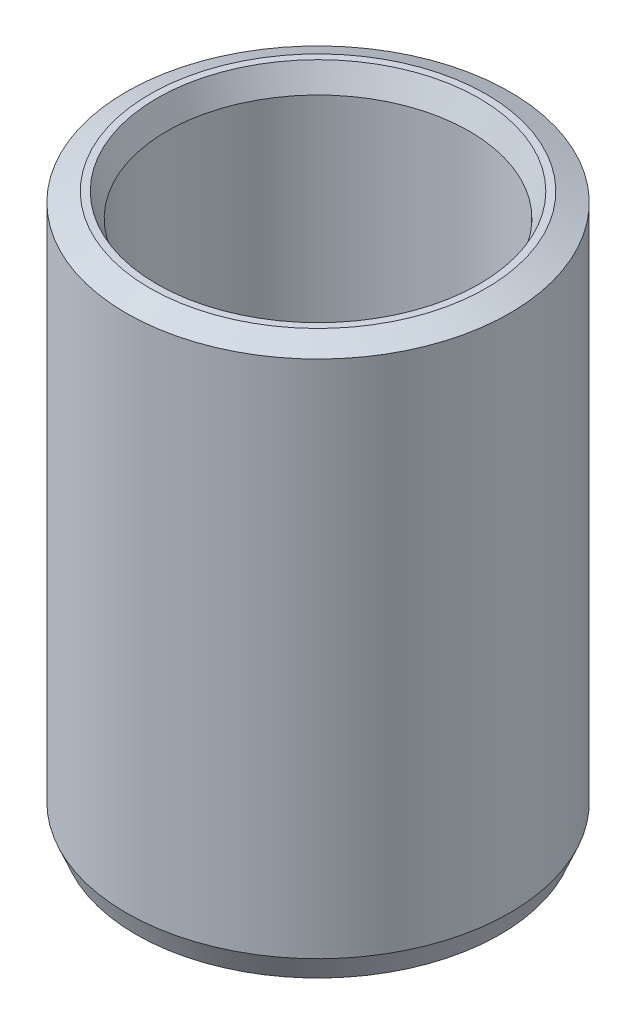
ISO-10303-21;
HEADER;
FILE_DESCRIPTION(('STEP AP214'),'2;1');
FILE_NAME('part.step','',(''),(''),'','','');
FILE_SCHEMA(('AUTOMOTIVE_DESIGN { 1 0 10303 214 1 1 1 1 }'));
ENDSEC;
DATA;
#1=APPLICATION_CONTEXT('core data for automotive mechanical design processes');
#2=APPLICATION_PROTOCOL_DEFINITION('international standard','automotive_design',2000,#1);
#3=PRODUCT_CONTEXT('',#1,'mechanical');
#4=PRODUCT('Part','Part','',(#3));
#5=PRODUCT_RELATED_PRODUCT_CATEGORY('part','',(#4));
#6=PRODUCT_DEFINITION_FORMATION('','',#4);
#7=PRODUCT_DEFINITION_CONTEXT('part definition',#1,'design');
#8=PRODUCT_DEFINITION('design','',#6,#7);
#9=PRODUCT_DEFINITION_SHAPE('','',#8);
#10=(LENGTH_UNIT() NAMED_UNIT(*) SI_UNIT(.MILLI.,.METRE.));
#11=(NAMED_UNIT(*) PLANE_ANGLE_UNIT() SI_UNIT($,.RADIAN.));
#12=(NAMED_UNIT(*) SI_UNIT($,.STERADIAN.) SOLID_ANGLE_UNIT());
#13=UNCERTAINTY_MEASURE_WITH_UNIT(LENGTH_MEASURE(1.E-05),#10,'distance_accuracy_value','');
#14=(GEOMETRIC_REPRESENTATION_CONTEXT(3) GLOBAL_UNCERTAINTY_ASSIGNED_CONTEXT((#13)) GLOBAL_UNIT_ASSIGNED_CONTEXT((#10,
#11,#12)) REPRESENTATION_CONTEXT('',''));
#15=CARTESIAN_POINT('',(0.,0.,0.));
#16=DIRECTION('',(0.,0.,1.));
#17=DIRECTION('',(1.,0.,0.));
#18=AXIS2_PLACEMENT_3D('',#15,#16,#17);
#19=CARTESIAN_POINT('',(0.,136.922978200939,0.));
#20=DIRECTION('',(0.,-1.,0.));
#21=DIRECTION('',(0.,0.,-1.));
#22=AXIS2_PLACEMENT_3D('',#19,#20,#21);
#23=CYLINDRICAL_SURFACE('',#22,47.5);
#24=CARTESIAN_POINT('',(0.,5.85644036440705,0.));
#25=DIRECTION('',(0.,1.,0.));
#26=DIRECTION('',(0.,0.,1.));
#27=AXIS2_PLACEMENT_3D('',#24,#25,#26);
#28=CIRCLE('',#27,47.5);
#29=CARTESIAN_POINT('',(0.,5.85644036440705,47.5));
#30=VERTEX_POINT('',#29);
#31=EDGE_CURVE('E10',#30,#30,#28,.T.);
#32=ORIENTED_EDGE('',*,*,#31,.T.);
#33=EDGE_LOOP('',(#32));
#34=FACE_BOUND('',#33,.T.);
#35=CARTESIAN_POINT('',(0.,134.491904274872,0.));
#36=DIRECTION('',(0.,1.,0.));
#37=DIRECTION('',(0.,0.,1.));
#38=AXIS2_PLACEMENT_3D('',#35,#36,#37);
#39=CIRCLE('',#38,47.5);
#40=CARTESIAN_POINT('',(0.,134.491904274872,47.5));
#41=VERTEX_POINT('',#40);
#42=EDGE_CURVE('E50',#41,#41,#39,.F.);
#43=ORIENTED_EDGE('',*,*,#42,.T.);
#44=EDGE_LOOP('',(#43));
#45=FACE_BOUND('',#44,.T.);
#46=ADVANCED_FACE('F39',(#34,#45),#23,.T.);
#47=CARTESIAN_POINT('',(0.,136.922978200939,0.));
#48=DIRECTION('',(0.,1.,0.));
#49=DIRECTION('',(0.,0.,1.));
#50=AXIS2_PLACEMENT_3D('',#47,#48,#49);
#51=PLANE('',#50);
#52=CARTESIAN_POINT('',(0.,136.922978200939,0.));
#53=DIRECTION('',(0.,1.,0.));
#54=DIRECTION('',(0.,0.,1.));
#55=AXIS2_PLACEMENT_3D('',#52,#53,#54);
#56=CIRCLE('',#55,39.8950034669377);
#57=CARTESIAN_POINT('',(0.,136.922978200939,39.8950034669377));
#58=VERTEX_POINT('',#57);
#59=EDGE_CURVE('E58',#58,#58,#56,.F.);
#60=ORIENTED_EDGE('',*,*,#59,.T.);
#61=EDGE_LOOP('',(#60));
#62=FACE_BOUND('',#61,.T.);
#63=CARTESIAN_POINT('',(0.,136.922978200939,0.));
#64=DIRECTION('',(0.,1.,0.));
#65=DIRECTION('',(0.,0.,1.));
#66=AXIS2_PLACEMENT_3D('',#63,#64,#65);
#67=CIRCLE('',#66,41.6435596355929);
#68=CARTESIAN_POINT('',(0.,136.922978200939,41.6435596355929));
#69=VERTEX_POINT('',#68);
#70=EDGE_CURVE('E61',#69,#69,#67,.T.);
#71=ORIENTED_EDGE('',*,*,#70,.T.);
#72=EDGE_LOOP('',(#71));
#73=FACE_BOUND('',#72,.T.);
#74=ADVANCED_FACE('F88',(#62,#73),#51,.T.);
#75=CARTESIAN_POINT('',(0.,0.,0.));
#76=DIRECTION('',(0.,1.,0.));
#77=DIRECTION('',(0.,0.,1.));
#78=AXIS2_PLACEMENT_3D('',#75,#76,#77);
#79=PLANE('',#78);
#80=CARTESIAN_POINT('',(0.,0.,0.));
#81=DIRECTION('',(0.,1.,0.));
#82=DIRECTION('',(0.,0.,1.));
#83=AXIS2_PLACEMENT_3D('',#80,#81,#82);
#84=CIRCLE('',#83,43.3203699052769);
#85=CARTESIAN_POINT('',(0.,0.,43.3203699052769));
#86=VERTEX_POINT('',#85);
#87=EDGE_CURVE('E51',#86,#86,#84,.T.);
#88=ORIENTED_EDGE('',*,*,#87,.T.);
#89=EDGE_LOOP('',(#88));
#90=FACE_BOUND('',#89,.T.);
#91=CARTESIAN_POINT('',(0.,0.,0.));
#92=DIRECTION('',(0.,1.,0.));
#93=DIRECTION('',(0.,0.,1.));
#94=AXIS2_PLACEMENT_3D('',#91,#92,#93);
#95=CIRCLE('',#94,45.0689260739321);
#96=CARTESIAN_POINT('',(0.,0.,45.0689260739321));
#97=VERTEX_POINT('',#96);
#98=EDGE_CURVE('E54',#97,#97,#95,.F.);
#99=ORIENTED_EDGE('',*,*,#98,.T.);
#100=EDGE_LOOP('',(#99));
#101=FACE_BOUND('',#100,.T.);
#102=ADVANCED_FACE('F83',(#90,#101),#79,.F.);
#103=CARTESIAN_POINT('',(0.,136.922978200939,0.));
#104=DIRECTION('',(0.,-1.,0.));
#105=DIRECTION('',(0.,0.,-1.));
#106=AXIS2_PLACEMENT_3D('',#103,#104,#105);
#107=CYLINDRICAL_SURFACE('',#106,37.4639295408697);
#108=CARTESIAN_POINT('',(0.,131.066537836532,0.));
#109=DIRECTION('',(0.,1.,0.));
#110=DIRECTION('',(0.,0.,1.));
#111=AXIS2_PLACEMENT_3D('',#108,#109,#110);
#112=CIRCLE('',#111,37.4639295408697);
#113=CARTESIAN_POINT('',(0.,131.066537836532,37.4639295408697));
#114=VERTEX_POINT('',#113);
#115=EDGE_CURVE('E67',#114,#114,#112,.T.);
#116=ORIENTED_EDGE('',*,*,#115,.T.);
#117=EDGE_LOOP('',(#116));
#118=FACE_BOUND('',#117,.T.);
#119=CARTESIAN_POINT('',(0.,2.43107392606795,0.));
#120=DIRECTION('',(0.,1.,0.));
#121=DIRECTION('',(0.,0.,1.));
#122=AXIS2_PLACEMENT_3D('',#119,#120,#121);
#123=CIRCLE('',#122,37.4639295408697);
#124=CARTESIAN_POINT('',(0.,2.43107392606795,37.4639295408697));
#125=VERTEX_POINT('',#124);
#126=EDGE_CURVE('E69',#125,#125,#123,.F.);
#127=ORIENTED_EDGE('',*,*,#126,.T.);
#128=EDGE_LOOP('',(#127));
#129=FACE_BOUND('',#128,.T.);
#130=ADVANCED_FACE('F71',(#118,#129),#107,.F.);
#131=CARTESIAN_POINT('',(0.,131.066537836532,0.));
#132=DIRECTION('',(0.,1.,0.));
#133=DIRECTION('',(0.,0.,1.));
#134=AXIS2_PLACEMENT_3D('',#131,#132,#133);
#135=CONICAL_SURFACE('',#134,37.4639295408697,0.393465011175618);
#136=ORIENTED_EDGE('',*,*,#59,.F.);
#137=EDGE_LOOP('',(#136));
#138=FACE_BOUND('',#137,.T.);
#139=ORIENTED_EDGE('',*,*,#115,.F.);
#140=EDGE_LOOP('',(#139));
#141=FACE_BOUND('',#140,.T.);
#142=ADVANCED_FACE('F77',(#138,#141),#135,.F.);
#143=CARTESIAN_POINT('',(0.,0.,0.));
#144=DIRECTION('',(0.,-1.,0.));
#145=DIRECTION('',(0.,0.,-1.));
#146=AXIS2_PLACEMENT_3D('',#143,#144,#145);
#147=CONICAL_SURFACE('',#146,43.3203699052769,1.17733131561928);
#148=ORIENTED_EDGE('',*,*,#126,.F.);
#149=EDGE_LOOP('',(#148));
#150=FACE_BOUND('',#149,.T.);
#151=ORIENTED_EDGE('',*,*,#87,.F.);
#152=EDGE_LOOP('',(#151));
#153=FACE_BOUND('',#152,.T.);
#154=ADVANCED_FACE('F73',(#150,#153),#147,.F.);
#155=CARTESIAN_POINT('',(0.,5.85644036440705,0.));
#156=DIRECTION('',(0.,1.,0.));
#157=DIRECTION('',(0.,0.,1.));
#158=AXIS2_PLACEMENT_3D('',#155,#156,#157);
#159=CONICAL_SURFACE('',#158,47.5,0.393465011175622);
#160=ORIENTED_EDGE('',*,*,#98,.F.);
#161=EDGE_LOOP('',(#160));
#162=FACE_BOUND('',#161,.T.);
#163=ORIENTED_EDGE('',*,*,#31,.F.);
#164=EDGE_LOOP('',(#163));
#165=FACE_BOUND('',#164,.T.);
#166=ADVANCED_FACE('F76',(#162,#165),#159,.T.);
#167=CARTESIAN_POINT('',(0.,136.922978200939,0.));
#168=DIRECTION('',(0.,-1.,0.));
#169=DIRECTION('',(0.,0.,-1.));
#170=AXIS2_PLACEMENT_3D('',#167,#168,#169);
#171=CONICAL_SURFACE('',#170,41.6435596355929,1.17733131561927);
#172=ORIENTED_EDGE('',*,*,#42,.F.);
#173=EDGE_LOOP('',(#172));
#174=FACE_BOUND('',#173,.T.);
#175=ORIENTED_EDGE('',*,*,#70,.F.);
#176=EDGE_LOOP('',(#175));
#177=FACE_BOUND('',#176,.T.);
#178=ADVANCED_FACE('F45',(#174,#177),#171,.T.);
#179=CLOSED_SHELL('',(#46,#74,#102,#130,#142,#154,#166,#178));
#180=MANIFOLD_SOLID_BREP('B2',#179);
#181=ADVANCED_BREP_SHAPE_REPRESENTATION('',(#18,#180),#14);
#182=SHAPE_DEFINITION_REPRESENTATION(#9,#181);
ENDSEC;
END-ISO-10303-21;
